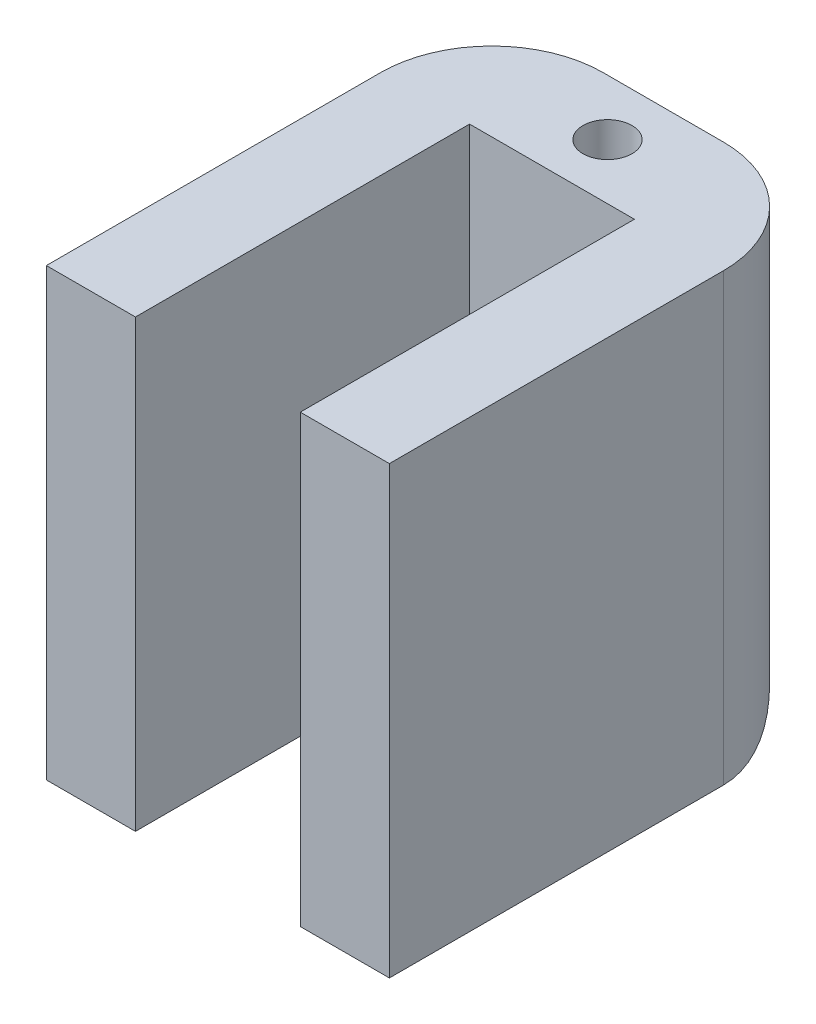
ISO-10303-21;
HEADER;
FILE_DESCRIPTION(('STEP AP214'),'2;1');
FILE_NAME('part.step','',(''),(''),'','','');
FILE_SCHEMA(('AUTOMOTIVE_DESIGN { 1 0 10303 214 1 1 1 1 }'));
ENDSEC;
DATA;
#1=APPLICATION_CONTEXT('core data for automotive mechanical design processes');
#2=APPLICATION_PROTOCOL_DEFINITION('international standard','automotive_design',2000,#1);
#3=PRODUCT_CONTEXT('',#1,'mechanical');
#4=PRODUCT('Part','Part','',(#3));
#5=PRODUCT_RELATED_PRODUCT_CATEGORY('part','',(#4));
#6=PRODUCT_DEFINITION_FORMATION('','',#4);
#7=PRODUCT_DEFINITION_CONTEXT('part definition',#1,'design');
#8=PRODUCT_DEFINITION('design','',#6,#7);
#9=PRODUCT_DEFINITION_SHAPE('','',#8);
#10=(LENGTH_UNIT() NAMED_UNIT(*) SI_UNIT(.MILLI.,.METRE.));
#11=(NAMED_UNIT(*) PLANE_ANGLE_UNIT() SI_UNIT($,.RADIAN.));
#12=(NAMED_UNIT(*) SI_UNIT($,.STERADIAN.) SOLID_ANGLE_UNIT());
#13=UNCERTAINTY_MEASURE_WITH_UNIT(LENGTH_MEASURE(1.E-05),#10,'distance_accuracy_value','');
#14=(GEOMETRIC_REPRESENTATION_CONTEXT(3) GLOBAL_UNCERTAINTY_ASSIGNED_CONTEXT((#13)) GLOBAL_UNIT_ASSIGNED_CONTEXT((#10,
#11,#12)) REPRESENTATION_CONTEXT('',''));
#15=CARTESIAN_POINT('',(0.,0.,0.));
#16=DIRECTION('',(0.,0.,1.));
#17=DIRECTION('',(1.,0.,0.));
#18=AXIS2_PLACEMENT_3D('',#15,#16,#17);
#19=CARTESIAN_POINT('',(0.,0.,0.));
#20=DIRECTION('',(0.,-1.,0.));
#21=DIRECTION('',(0.,0.,-1.));
#22=AXIS2_PLACEMENT_3D('',#19,#20,#21);
#23=PLANE('',#22);
#24=DIRECTION('',(0.,0.,1.));
#25=VECTOR('',#24,1.);
#26=CARTESIAN_POINT('',(-5.3980701754386,0.,-19.1149122807018));
#27=LINE('',#26,#25);
#28=CARTESIAN_POINT('',(-5.3980701754386,0.,-12.7649122807018));
#29=VERTEX_POINT('',#28);
#30=CARTESIAN_POINT('',(-5.3980701754386,0.,6.28508771929825));
#31=VERTEX_POINT('',#30);
#32=EDGE_CURVE('E128',#29,#31,#27,.T.);
#33=ORIENTED_EDGE('',*,*,#32,.F.);
#34=DIRECTION('',(-1.,0.,0.));
#35=VECTOR('',#34,1.);
#36=CARTESIAN_POINT('',(14.1599298245614,0.,-12.7649122807018));
#37=LINE('',#36,#35);
#38=CARTESIAN_POINT('',(-0.318070175438597,0.,-12.7649122807018));
#39=VERTEX_POINT('',#38);
#40=EDGE_CURVE('E11',#29,#39,#37,.F.);
#41=ORIENTED_EDGE('',*,*,#40,.T.);
#42=DIRECTION('',(0.,0.,-1.));
#43=VECTOR('',#42,1.);
#44=CARTESIAN_POINT('',(-0.318070175438597,0.,6.28508771929824));
#45=LINE('',#44,#43);
#46=CARTESIAN_POINT('',(-0.318070175438597,0.,6.28508771929824));
#47=VERTEX_POINT('',#46);
#48=EDGE_CURVE('E179',#47,#39,#45,.T.);
#49=ORIENTED_EDGE('',*,*,#48,.F.);
#50=DIRECTION('',(1.,0.,0.));
#51=VECTOR('',#50,1.);
#52=CARTESIAN_POINT('',(-0.318070175438597,0.,6.28508771929824));
#53=LINE('',#52,#51);
#54=EDGE_CURVE('E177',#31,#47,#53,.T.);
#55=ORIENTED_EDGE('',*,*,#54,.F.);
#56=EDGE_LOOP('',(#33,#41,#49,#55));
#57=FACE_BOUND('',#56,.T.);
#58=ADVANCED_FACE('F33',(#57),#23,.T.);
#59=CARTESIAN_POINT('',(-5.3980701754386,25.4,-19.1149122807018));
#60=DIRECTION('',(1.,0.,0.));
#61=DIRECTION('',(0.,0.,-1.));
#62=AXIS2_PLACEMENT_3D('',#59,#60,#61);
#63=PLANE('',#62);
#64=DIRECTION('',(0.,0.,1.));
#65=VECTOR('',#64,1.);
#66=CARTESIAN_POINT('',(-5.3980701754386,25.4,-19.1149122807018));
#67=LINE('',#66,#65);
#68=CARTESIAN_POINT('',(-5.3980701754386,25.4,-12.7649122807018));
#69=VERTEX_POINT('',#68);
#70=CARTESIAN_POINT('',(-5.3980701754386,25.4,6.28508771929825));
#71=VERTEX_POINT('',#70);
#72=EDGE_CURVE('E109',#69,#71,#67,.T.);
#73=ORIENTED_EDGE('',*,*,#72,.F.);
#74=DIRECTION('',(0.,-1.,0.));
#75=VECTOR('',#74,1.);
#76=CARTESIAN_POINT('',(-5.3980701754386,25.4,-12.7649122807018));
#77=LINE('',#76,#75);
#78=EDGE_CURVE('E50',#69,#29,#77,.T.);
#79=ORIENTED_EDGE('',*,*,#78,.T.);
#80=ORIENTED_EDGE('',*,*,#32,.T.);
#81=DIRECTION('',(0.,-1.,0.));
#82=VECTOR('',#81,1.);
#83=CARTESIAN_POINT('',(-5.3980701754386,25.4,6.28508771929825));
#84=LINE('',#83,#82);
#85=EDGE_CURVE('E121',#71,#31,#84,.T.);
#86=ORIENTED_EDGE('',*,*,#85,.F.);
#87=EDGE_LOOP('',(#73,#79,#80,#86));
#88=FACE_BOUND('',#87,.T.);
#89=ADVANCED_FACE('F127',(#88),#63,.F.);
#90=CARTESIAN_POINT('',(-0.318070175438597,25.4,6.28508771929824));
#91=DIRECTION('',(0.,0.,-1.));
#92=DIRECTION('',(-1.,0.,0.));
#93=AXIS2_PLACEMENT_3D('',#90,#91,#92);
#94=PLANE('',#93);
#95=ORIENTED_EDGE('',*,*,#54,.T.);
#96=DIRECTION('',(0.,-1.,0.));
#97=VECTOR('',#96,1.);
#98=CARTESIAN_POINT('',(-0.318070175438597,25.4,6.28508771929824));
#99=LINE('',#98,#97);
#100=CARTESIAN_POINT('',(-0.318070175438597,25.4,6.28508771929824));
#101=VERTEX_POINT('',#100);
#102=EDGE_CURVE('E123',#101,#47,#99,.T.);
#103=ORIENTED_EDGE('',*,*,#102,.F.);
#104=DIRECTION('',(1.,0.,0.));
#105=VECTOR('',#104,1.);
#106=CARTESIAN_POINT('',(-0.318070175438597,25.4,6.28508771929824));
#107=LINE('',#106,#105);
#108=EDGE_CURVE('E113',#71,#101,#107,.T.);
#109=ORIENTED_EDGE('',*,*,#108,.F.);
#110=ORIENTED_EDGE('',*,*,#85,.T.);
#111=EDGE_LOOP('',(#95,#103,#109,#110));
#112=FACE_BOUND('',#111,.T.);
#113=ADVANCED_FACE('F120',(#112),#94,.F.);
#114=CARTESIAN_POINT('',(-0.318070175438597,25.4,6.28508771929824));
#115=DIRECTION('',(-1.,0.,0.));
#116=DIRECTION('',(0.,0.,1.));
#117=AXIS2_PLACEMENT_3D('',#114,#115,#116);
#118=PLANE('',#117);
#119=ORIENTED_EDGE('',*,*,#48,.T.);
#120=DIRECTION('',(0.,-1.,0.));
#121=VECTOR('',#120,1.);
#122=CARTESIAN_POINT('',(-0.318070175438597,25.4,-12.7649122807018));
#123=LINE('',#122,#121);
#124=CARTESIAN_POINT('',(-0.318070175438597,25.4,-12.7649122807018));
#125=VERTEX_POINT('',#124);
#126=EDGE_CURVE('E134',#125,#39,#123,.T.);
#127=ORIENTED_EDGE('',*,*,#126,.F.);
#128=DIRECTION('',(0.,0.,-1.));
#129=VECTOR('',#128,1.);
#130=CARTESIAN_POINT('',(-0.318070175438597,25.4,6.28508771929824));
#131=LINE('',#130,#129);
#132=EDGE_CURVE('E125',#101,#125,#131,.T.);
#133=ORIENTED_EDGE('',*,*,#132,.F.);
#134=ORIENTED_EDGE('',*,*,#102,.T.);
#135=EDGE_LOOP('',(#119,#127,#133,#134));
#136=FACE_BOUND('',#135,.T.);
#137=ADVANCED_FACE('F255',(#136),#118,.F.);
#138=CARTESIAN_POINT('',(-0.318070175438597,25.4,-12.7649122807018));
#139=DIRECTION('',(0.,0.,-1.));
#140=DIRECTION('',(-1.,0.,0.));
#141=AXIS2_PLACEMENT_3D('',#138,#139,#140);
#142=PLANE('',#141);
#143=DIRECTION('',(1.,0.,0.));
#144=VECTOR('',#143,1.);
#145=CARTESIAN_POINT('',(-0.318070175438597,0.,-12.7649122807018));
#146=LINE('',#145,#144);
#147=CARTESIAN_POINT('',(9.0799298245614,0.,-12.7649122807018));
#148=VERTEX_POINT('',#147);
#149=EDGE_CURVE('E182',#39,#148,#146,.T.);
#150=ORIENTED_EDGE('',*,*,#149,.T.);
#151=DIRECTION('',(0.,-1.,0.));
#152=VECTOR('',#151,1.);
#153=CARTESIAN_POINT('',(9.0799298245614,25.4,-12.7649122807018));
#154=LINE('',#153,#152);
#155=CARTESIAN_POINT('',(9.0799298245614,25.4,-12.7649122807018));
#156=VERTEX_POINT('',#155);
#157=EDGE_CURVE('E195',#156,#148,#154,.T.);
#158=ORIENTED_EDGE('',*,*,#157,.F.);
#159=DIRECTION('',(1.,0.,0.));
#160=VECTOR('',#159,1.);
#161=CARTESIAN_POINT('',(-0.318070175438597,25.4,-12.7649122807018));
#162=LINE('',#161,#160);
#163=EDGE_CURVE('E165',#125,#156,#162,.T.);
#164=ORIENTED_EDGE('',*,*,#163,.F.);
#165=ORIENTED_EDGE('',*,*,#126,.T.);
#166=EDGE_LOOP('',(#150,#158,#164,#165));
#167=FACE_BOUND('',#166,.T.);
#168=ADVANCED_FACE('F202',(#167),#142,.F.);
#169=CARTESIAN_POINT('',(9.0799298245614,25.4,6.28508771929824));
#170=DIRECTION('',(1.,0.,0.));
#171=DIRECTION('',(0.,0.,-1.));
#172=AXIS2_PLACEMENT_3D('',#169,#170,#171);
#173=PLANE('',#172);
#174=DIRECTION('',(0.,0.,1.));
#175=VECTOR('',#174,1.);
#176=CARTESIAN_POINT('',(9.0799298245614,0.,6.28508771929824));
#177=LINE('',#176,#175);
#178=CARTESIAN_POINT('',(9.0799298245614,0.,6.28508771929824));
#179=VERTEX_POINT('',#178);
#180=EDGE_CURVE('E184',#148,#179,#177,.T.);
#181=ORIENTED_EDGE('',*,*,#180,.T.);
#182=DIRECTION('',(0.,-1.,0.));
#183=VECTOR('',#182,1.);
#184=CARTESIAN_POINT('',(9.0799298245614,25.4,6.28508771929824));
#185=LINE('',#184,#183);
#186=CARTESIAN_POINT('',(9.0799298245614,25.4,6.28508771929824));
#187=VERTEX_POINT('',#186);
#188=EDGE_CURVE('E192',#187,#179,#185,.T.);
#189=ORIENTED_EDGE('',*,*,#188,.F.);
#190=DIRECTION('',(0.,0.,1.));
#191=VECTOR('',#190,1.);
#192=CARTESIAN_POINT('',(9.0799298245614,25.4,6.28508771929824));
#193=LINE('',#192,#191);
#194=EDGE_CURVE('E167',#156,#187,#193,.T.);
#195=ORIENTED_EDGE('',*,*,#194,.F.);
#196=ORIENTED_EDGE('',*,*,#157,.T.);
#197=EDGE_LOOP('',(#181,#189,#195,#196));
#198=FACE_BOUND('',#197,.T.);
#199=ADVANCED_FACE('F248',(#198),#173,.F.);
#200=CARTESIAN_POINT('',(9.0799298245614,25.4,6.28508771929824));
#201=DIRECTION('',(0.,0.,-1.));
#202=DIRECTION('',(-1.,0.,0.));
#203=AXIS2_PLACEMENT_3D('',#200,#201,#202);
#204=PLANE('',#203);
#205=DIRECTION('',(1.,0.,0.));
#206=VECTOR('',#205,1.);
#207=CARTESIAN_POINT('',(9.0799298245614,0.,6.28508771929824));
#208=LINE('',#207,#206);
#209=CARTESIAN_POINT('',(14.1599298245614,0.,6.28508771929824));
#210=VERTEX_POINT('',#209);
#211=EDGE_CURVE('E186',#179,#210,#208,.T.);
#212=ORIENTED_EDGE('',*,*,#211,.T.);
#213=DIRECTION('',(0.,-1.,0.));
#214=VECTOR('',#213,1.);
#215=CARTESIAN_POINT('',(14.1599298245614,25.4,6.28508771929824));
#216=LINE('',#215,#214);
#217=CARTESIAN_POINT('',(14.1599298245614,25.4,6.28508771929824));
#218=VERTEX_POINT('',#217);
#219=EDGE_CURVE('E175',#218,#210,#216,.T.);
#220=ORIENTED_EDGE('',*,*,#219,.F.);
#221=DIRECTION('',(1.,0.,0.));
#222=VECTOR('',#221,1.);
#223=CARTESIAN_POINT('',(9.0799298245614,25.4,6.28508771929824));
#224=LINE('',#223,#222);
#225=EDGE_CURVE('E169',#187,#218,#224,.T.);
#226=ORIENTED_EDGE('',*,*,#225,.F.);
#227=ORIENTED_EDGE('',*,*,#188,.T.);
#228=EDGE_LOOP('',(#212,#220,#226,#227));
#229=FACE_BOUND('',#228,.T.);
#230=ADVANCED_FACE('F245',(#229),#204,.F.);
#231=CARTESIAN_POINT('',(14.1599298245614,25.4,-19.1149122807018));
#232=DIRECTION('',(-1.,0.,0.));
#233=DIRECTION('',(0.,0.,1.));
#234=AXIS2_PLACEMENT_3D('',#231,#232,#233);
#235=PLANE('',#234);
#236=DIRECTION('',(0.,0.,-1.));
#237=VECTOR('',#236,1.);
#238=CARTESIAN_POINT('',(14.1599298245614,0.,-19.1149122807018));
#239=LINE('',#238,#237);
#240=CARTESIAN_POINT('',(14.1599298245614,0.,-12.7649122807018));
#241=VERTEX_POINT('',#240);
#242=EDGE_CURVE('E116',#210,#241,#239,.T.);
#243=ORIENTED_EDGE('',*,*,#242,.T.);
#244=DIRECTION('',(0.,-1.,0.));
#245=VECTOR('',#244,1.);
#246=CARTESIAN_POINT('',(14.1599298245614,25.4,-12.7649122807018));
#247=LINE('',#246,#245);
#248=CARTESIAN_POINT('',(14.1599298245614,25.4,-12.7649122807018));
#249=VERTEX_POINT('',#248);
#250=EDGE_CURVE('E142',#241,#249,#247,.F.);
#251=ORIENTED_EDGE('',*,*,#250,.T.);
#252=DIRECTION('',(0.,0.,-1.));
#253=VECTOR('',#252,1.);
#254=CARTESIAN_POINT('',(14.1599298245614,25.4,-19.1149122807018));
#255=LINE('',#254,#253);
#256=EDGE_CURVE('E171',#218,#249,#255,.T.);
#257=ORIENTED_EDGE('',*,*,#256,.F.);
#258=ORIENTED_EDGE('',*,*,#219,.T.);
#259=EDGE_LOOP('',(#243,#251,#257,#258));
#260=FACE_BOUND('',#259,.T.);
#261=ADVANCED_FACE('F215',(#260),#235,.F.);
#262=CARTESIAN_POINT('',(-5.3980701754386,25.4,-19.1149122807018));
#263=DIRECTION('',(0.,0.,1.));
#264=DIRECTION('',(1.,0.,0.));
#265=AXIS2_PLACEMENT_3D('',#262,#263,#264);
#266=PLANE('',#265);
#267=DIRECTION('',(-1.,0.,0.));
#268=VECTOR('',#267,1.);
#269=CARTESIAN_POINT('',(-5.3980701754386,25.4,-19.1149122807018));
#270=LINE('',#269,#268);
#271=CARTESIAN_POINT('',(7.8099298245614,25.4,-19.1149122807018));
#272=VERTEX_POINT('',#271);
#273=CARTESIAN_POINT('',(0.951929824561401,25.4,-19.1149122807018));
#274=VERTEX_POINT('',#273);
#275=EDGE_CURVE('E173',#272,#274,#270,.T.);
#276=ORIENTED_EDGE('',*,*,#275,.F.);
#277=DIRECTION('',(0.,-1.,0.));
#278=VECTOR('',#277,1.);
#279=CARTESIAN_POINT('',(7.8099298245614,25.4,-19.1149122807018));
#280=LINE('',#279,#278);
#281=CARTESIAN_POINT('',(7.8099298245614,6.35,-19.1149122807018));
#282=VERTEX_POINT('',#281);
#283=EDGE_CURVE('E139',#272,#282,#280,.T.);
#284=ORIENTED_EDGE('',*,*,#283,.T.);
#285=DIRECTION('',(-1.,0.,0.));
#286=VECTOR('',#285,1.);
#287=CARTESIAN_POINT('',(-5.3980701754386,6.35,-19.1149122807018));
#288=LINE('',#287,#286);
#289=CARTESIAN_POINT('',(0.951929824561401,6.35,-19.1149122807018));
#290=VERTEX_POINT('',#289);
#291=EDGE_CURVE('E130',#282,#290,#288,.T.);
#292=ORIENTED_EDGE('',*,*,#291,.T.);
#293=DIRECTION('',(0.,-1.,0.));
#294=VECTOR('',#293,1.);
#295=CARTESIAN_POINT('',(0.951929824561401,25.4,-19.1149122807018));
#296=LINE('',#295,#294);
#297=EDGE_CURVE('E132',#290,#274,#296,.F.);
#298=ORIENTED_EDGE('',*,*,#297,.T.);
#299=EDGE_LOOP('',(#276,#284,#292,#298));
#300=FACE_BOUND('',#299,.T.);
#301=ADVANCED_FACE('F222',(#300),#266,.F.);
#302=CARTESIAN_POINT('',(0.,25.4,0.));
#303=DIRECTION('',(0.,-1.,0.));
#304=DIRECTION('',(0.,0.,-1.));
#305=AXIS2_PLACEMENT_3D('',#302,#303,#304);
#306=PLANE('',#305);
#307=CARTESIAN_POINT('',(4.3809298245614,25.4,-15.9283370572575));
#308=DIRECTION('',(0.,1.,0.));
#309=DIRECTION('',(0.,0.,1.));
#310=AXIS2_PLACEMENT_3D('',#307,#308,#309);
#311=CIRCLE('',#310,1.397);
#312=CARTESIAN_POINT('',(4.3809298245614,25.4,-14.5313370572575));
#313=VERTEX_POINT('',#312);
#314=EDGE_CURVE('E157',#313,#313,#311,.T.);
#315=ORIENTED_EDGE('',*,*,#314,.F.);
#316=EDGE_LOOP('',(#315));
#317=FACE_BOUND('',#316,.T.);
#318=ORIENTED_EDGE('',*,*,#256,.T.);
#319=CARTESIAN_POINT('',(7.8099298245614,25.4,-12.7649122807018));
#320=DIRECTION('',(0.,-1.,0.));
#321=DIRECTION('',(0.,0.,-1.));
#322=AXIS2_PLACEMENT_3D('',#319,#320,#321);
#323=CIRCLE('',#322,6.35);
#324=EDGE_CURVE('E145',#249,#272,#323,.F.);
#325=ORIENTED_EDGE('',*,*,#324,.T.);
#326=ORIENTED_EDGE('',*,*,#275,.T.);
#327=CARTESIAN_POINT('',(0.951929824561401,25.4,-12.7649122807018));
#328=DIRECTION('',(0.,-1.,0.));
#329=DIRECTION('',(0.,0.,-1.));
#330=AXIS2_PLACEMENT_3D('',#327,#328,#329);
#331=CIRCLE('',#330,6.35);
#332=EDGE_CURVE('E58',#274,#69,#331,.F.);
#333=ORIENTED_EDGE('',*,*,#332,.T.);
#334=ORIENTED_EDGE('',*,*,#72,.T.);
#335=ORIENTED_EDGE('',*,*,#108,.T.);
#336=ORIENTED_EDGE('',*,*,#132,.T.);
#337=ORIENTED_EDGE('',*,*,#163,.T.);
#338=ORIENTED_EDGE('',*,*,#194,.T.);
#339=ORIENTED_EDGE('',*,*,#225,.T.);
#340=EDGE_LOOP('',(#318,#325,#326,#333,#334,#335,#336,#337,#338,#339));
#341=FACE_BOUND('',#340,.T.);
#342=ADVANCED_FACE('F112',(#317,#341),#306,.F.);
#343=ORIENTED_EDGE('',*,*,#180,.F.);
#344=DIRECTION('',(-1.,0.,0.));
#345=VECTOR('',#344,1.);
#346=CARTESIAN_POINT('',(14.1599298245614,0.,-12.7649122807018));
#347=LINE('',#346,#345);
#348=EDGE_CURVE('E42',#148,#241,#347,.F.);
#349=ORIENTED_EDGE('',*,*,#348,.T.);
#350=ORIENTED_EDGE('',*,*,#242,.F.);
#351=ORIENTED_EDGE('',*,*,#211,.F.);
#352=EDGE_LOOP('',(#343,#349,#350,#351));
#353=FACE_BOUND('',#352,.T.);
#354=ADVANCED_FACE('F212',(#353),#23,.T.);
#355=CARTESIAN_POINT('',(0.951929824561401,25.4,-12.7649122807018));
#356=DIRECTION('',(0.,-1.,0.));
#357=DIRECTION('',(0.,0.,-1.));
#358=AXIS2_PLACEMENT_3D('',#355,#356,#357);
#359=CYLINDRICAL_SURFACE('',#358,6.35);
#360=ORIENTED_EDGE('',*,*,#332,.F.);
#361=ORIENTED_EDGE('',*,*,#297,.F.);
#362=CARTESIAN_POINT('',(0.951929824561401,6.35,-12.7649122807018));
#363=DIRECTION('',(0.707106781186547,-0.707106781186547,0.));
#364=DIRECTION('',(0.707106781186547,0.707106781186547,0.));
#365=AXIS2_PLACEMENT_3D('',#362,#363,#364);
#366=ELLIPSE('',#365,8.98025612106915,6.35);
#367=EDGE_CURVE('E37',#29,#290,#366,.T.);
#368=ORIENTED_EDGE('',*,*,#367,.F.);
#369=ORIENTED_EDGE('',*,*,#78,.F.);
#370=EDGE_LOOP('',(#360,#361,#368,#369));
#371=FACE_BOUND('',#370,.T.);
#372=ADVANCED_FACE('F35',(#371),#359,.T.);
#373=CARTESIAN_POINT('',(-5.3980701754386,6.35,-12.7649122807018));
#374=DIRECTION('',(1.,0.,0.));
#375=DIRECTION('',(0.,0.,-1.));
#376=AXIS2_PLACEMENT_3D('',#373,#374,#375);
#377=CYLINDRICAL_SURFACE('',#376,6.35);
#378=ORIENTED_EDGE('',*,*,#367,.T.);
#379=ORIENTED_EDGE('',*,*,#291,.F.);
#380=CARTESIAN_POINT('',(7.8099298245614,6.35,-12.7649122807018));
#381=DIRECTION('',(0.707106781186547,0.707106781186547,0.));
#382=DIRECTION('',(0.707106781186547,-0.707106781186547,0.));
#383=AXIS2_PLACEMENT_3D('',#380,#381,#382);
#384=ELLIPSE('',#383,8.98025612106915,6.35);
#385=EDGE_CURVE('E148',#241,#282,#384,.T.);
#386=ORIENTED_EDGE('',*,*,#385,.F.);
#387=ORIENTED_EDGE('',*,*,#348,.F.);
#388=ORIENTED_EDGE('',*,*,#149,.F.);
#389=ORIENTED_EDGE('',*,*,#40,.F.);
#390=EDGE_LOOP('',(#378,#379,#386,#387,#388,#389));
#391=FACE_BOUND('',#390,.T.);
#392=ADVANCED_FACE('F208',(#391),#377,.T.);
#393=CARTESIAN_POINT('',(7.8099298245614,25.4,-12.7649122807018));
#394=DIRECTION('',(0.,-1.,0.));
#395=DIRECTION('',(0.,0.,-1.));
#396=AXIS2_PLACEMENT_3D('',#393,#394,#395);
#397=CYLINDRICAL_SURFACE('',#396,6.35);
#398=ORIENTED_EDGE('',*,*,#324,.F.);
#399=ORIENTED_EDGE('',*,*,#250,.F.);
#400=ORIENTED_EDGE('',*,*,#385,.T.);
#401=ORIENTED_EDGE('',*,*,#283,.F.);
#402=EDGE_LOOP('',(#398,#399,#400,#401));
#403=FACE_BOUND('',#402,.T.);
#404=ADVANCED_FACE('F219',(#403),#397,.T.);
#405=CARTESIAN_POINT('',(4.3809298245614,12.7,-15.9283370572575));
#406=DIRECTION('',(0.,1.,0.));
#407=DIRECTION('',(0.,0.,1.));
#408=AXIS2_PLACEMENT_3D('',#405,#406,#407);
#409=CYLINDRICAL_SURFACE('',#408,1.397);
#410=CARTESIAN_POINT('',(4.3809298245614,12.7,-15.9283370572575));
#411=DIRECTION('',(0.,1.,0.));
#412=DIRECTION('',(0.,0.,1.));
#413=AXIS2_PLACEMENT_3D('',#410,#411,#412);
#414=CIRCLE('',#413,1.397);
#415=CARTESIAN_POINT('',(4.3809298245614,12.7,-14.5313370572575));
#416=VERTEX_POINT('',#415);
#417=EDGE_CURVE('E149',#416,#416,#414,.T.);
#418=ORIENTED_EDGE('',*,*,#417,.F.);
#419=EDGE_LOOP('',(#418));
#420=FACE_BOUND('',#419,.T.);
#421=ORIENTED_EDGE('',*,*,#314,.T.);
#422=EDGE_LOOP('',(#421));
#423=FACE_BOUND('',#422,.T.);
#424=ADVANCED_FACE('F261',(#420,#423),#409,.F.);
#425=CARTESIAN_POINT('',(4.3809298245614,12.7,-15.9283370572575));
#426=DIRECTION('',(0.,1.,0.));
#427=DIRECTION('',(0.,0.,1.));
#428=AXIS2_PLACEMENT_3D('',#425,#426,#427);
#429=PLANE('',#428);
#430=ORIENTED_EDGE('',*,*,#417,.T.);
#431=EDGE_LOOP('',(#430));
#432=FACE_BOUND('',#431,.T.);
#433=ADVANCED_FACE('F265',(#432),#429,.T.);
#434=CLOSED_SHELL('',(#58,#89,#113,#137,#168,#199,#230,#261,#301,#342,#354,#372,#392,#404,#424,#433));
#435=MANIFOLD_SOLID_BREP('B2',#434);
#436=ADVANCED_BREP_SHAPE_REPRESENTATION('',(#18,#435),#14);
#437=SHAPE_DEFINITION_REPRESENTATION(#9,#436);
ENDSEC;
END-ISO-10303-21;
